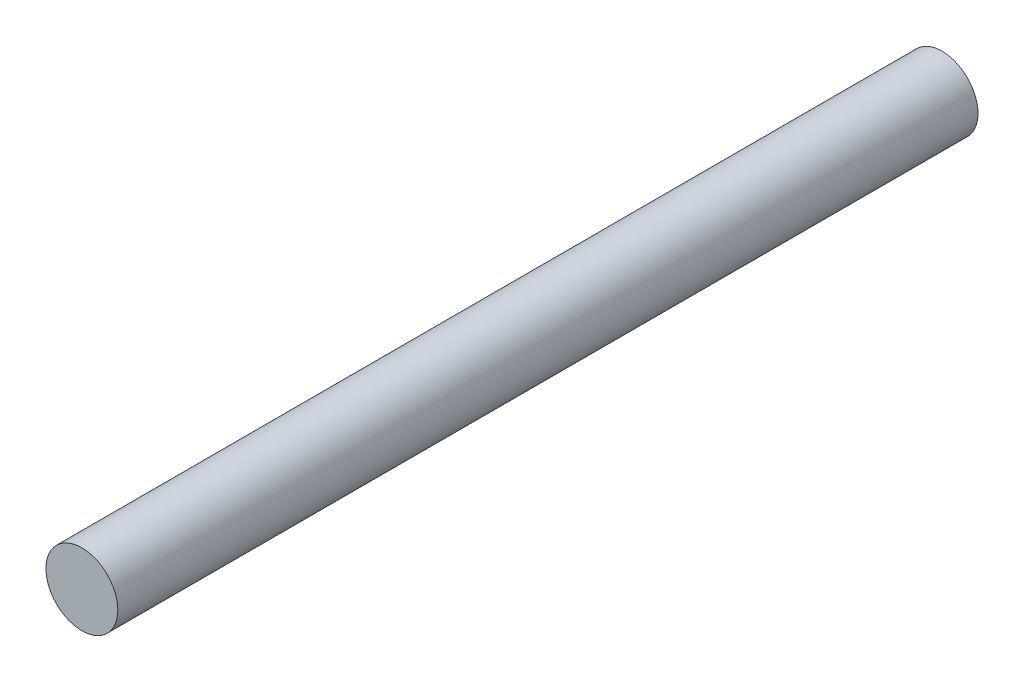
ISO-10303-21;
HEADER;
FILE_DESCRIPTION(('STEP AP214'),'2;1');
FILE_NAME('part.step','',(''),(''),'','','');
FILE_SCHEMA(('AUTOMOTIVE_DESIGN { 1 0 10303 214 1 1 1 1 }'));
ENDSEC;
DATA;
#1=APPLICATION_CONTEXT('core data for automotive mechanical design processes');
#2=APPLICATION_PROTOCOL_DEFINITION('international standard','automotive_design',2000,#1);
#3=PRODUCT_CONTEXT('',#1,'mechanical');
#4=PRODUCT('Part','Part','',(#3));
#5=PRODUCT_RELATED_PRODUCT_CATEGORY('part','',(#4));
#6=PRODUCT_DEFINITION_FORMATION('','',#4);
#7=PRODUCT_DEFINITION_CONTEXT('part definition',#1,'design');
#8=PRODUCT_DEFINITION('design','',#6,#7);
#9=PRODUCT_DEFINITION_SHAPE('','',#8);
#10=(LENGTH_UNIT() NAMED_UNIT(*) SI_UNIT(.MILLI.,.METRE.));
#11=(NAMED_UNIT(*) PLANE_ANGLE_UNIT() SI_UNIT($,.RADIAN.));
#12=(NAMED_UNIT(*) SI_UNIT($,.STERADIAN.) SOLID_ANGLE_UNIT());
#13=UNCERTAINTY_MEASURE_WITH_UNIT(LENGTH_MEASURE(1.E-05),#10,'distance_accuracy_value','');
#14=(GEOMETRIC_REPRESENTATION_CONTEXT(3) GLOBAL_UNCERTAINTY_ASSIGNED_CONTEXT((#13)) GLOBAL_UNIT_ASSIGNED_CONTEXT((#10,
#11,#12)) REPRESENTATION_CONTEXT('',''));
#15=CARTESIAN_POINT('',(0.,0.,0.));
#16=DIRECTION('',(0.,0.,1.));
#17=DIRECTION('',(1.,0.,0.));
#18=AXIS2_PLACEMENT_3D('',#15,#16,#17);
#19=CARTESIAN_POINT('',(0.,0.,760.));
#20=DIRECTION('',(0.,0.,-1.));
#21=DIRECTION('',(-1.,0.,0.));
#22=AXIS2_PLACEMENT_3D('',#19,#20,#21);
#23=CYLINDRICAL_SURFACE('',#22,31.75);
#24=CARTESIAN_POINT('',(0.,0.,760.));
#25=DIRECTION('',(0.,0.,1.));
#26=DIRECTION('',(1.,0.,0.));
#27=AXIS2_PLACEMENT_3D('',#24,#25,#26);
#28=CIRCLE('',#27,31.75);
#29=CARTESIAN_POINT('',(31.75,0.,760.));
#30=VERTEX_POINT('',#29);
#31=EDGE_CURVE('E10',#30,#30,#28,.T.);
#32=ORIENTED_EDGE('',*,*,#31,.F.);
#33=EDGE_LOOP('',(#32));
#34=FACE_BOUND('',#33,.T.);
#35=CARTESIAN_POINT('',(0.,0.,0.));
#36=DIRECTION('',(0.,0.,1.));
#37=DIRECTION('',(1.,0.,0.));
#38=AXIS2_PLACEMENT_3D('',#35,#36,#37);
#39=CIRCLE('',#38,31.75);
#40=CARTESIAN_POINT('',(31.75,0.,0.));
#41=VERTEX_POINT('',#40);
#42=EDGE_CURVE('E34',#41,#41,#39,.T.);
#43=ORIENTED_EDGE('',*,*,#42,.T.);
#44=EDGE_LOOP('',(#43));
#45=FACE_BOUND('',#44,.T.);
#46=ADVANCED_FACE('F31',(#34,#45),#23,.T.);
#47=CARTESIAN_POINT('',(0.,0.,760.));
#48=DIRECTION('',(0.,0.,1.));
#49=DIRECTION('',(1.,0.,0.));
#50=AXIS2_PLACEMENT_3D('',#47,#48,#49);
#51=PLANE('',#50);
#52=ORIENTED_EDGE('',*,*,#31,.T.);
#53=EDGE_LOOP('',(#52));
#54=FACE_BOUND('',#53,.T.);
#55=ADVANCED_FACE('F46',(#54),#51,.T.);
#56=CARTESIAN_POINT('',(0.,0.,0.));
#57=DIRECTION('',(0.,0.,1.));
#58=DIRECTION('',(1.,0.,0.));
#59=AXIS2_PLACEMENT_3D('',#56,#57,#58);
#60=PLANE('',#59);
#61=ORIENTED_EDGE('',*,*,#42,.F.);
#62=EDGE_LOOP('',(#61));
#63=FACE_BOUND('',#62,.T.);
#64=ADVANCED_FACE('F44',(#63),#60,.F.);
#65=CLOSED_SHELL('',(#46,#55,#64));
#66=MANIFOLD_SOLID_BREP('B2',#65);
#67=ADVANCED_BREP_SHAPE_REPRESENTATION('',(#18,#66),#14);
#68=SHAPE_DEFINITION_REPRESENTATION(#9,#67);
ENDSEC;
END-ISO-10303-21;
